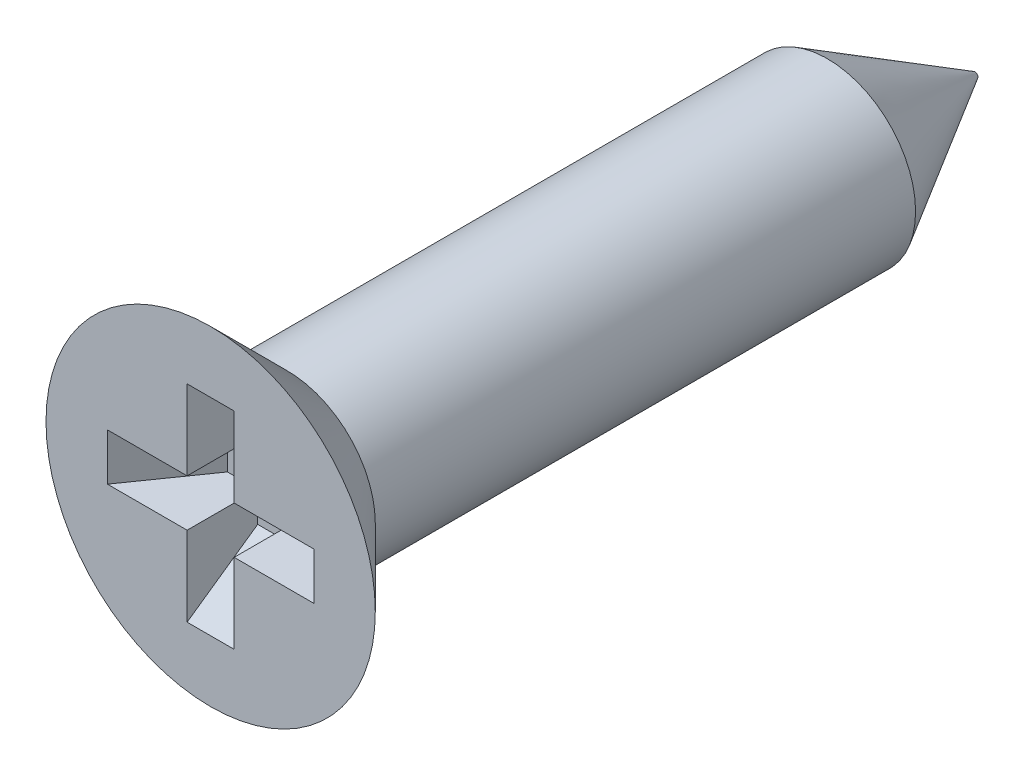
ISO-10303-21;
HEADER;
FILE_DESCRIPTION(('STEP AP214'),'2;1');
FILE_NAME('part.step','',(''),(''),'','','');
FILE_SCHEMA(('AUTOMOTIVE_DESIGN { 1 0 10303 214 1 1 1 1 }'));
ENDSEC;
DATA;
#1=APPLICATION_CONTEXT('core data for automotive mechanical design processes');
#2=APPLICATION_PROTOCOL_DEFINITION('international standard','automotive_design',2000,#1);
#3=PRODUCT_CONTEXT('',#1,'mechanical');
#4=PRODUCT('Part','Part','',(#3));
#5=PRODUCT_RELATED_PRODUCT_CATEGORY('part','',(#4));
#6=PRODUCT_DEFINITION_FORMATION('','',#4);
#7=PRODUCT_DEFINITION_CONTEXT('part definition',#1,'design');
#8=PRODUCT_DEFINITION('design','',#6,#7);
#9=PRODUCT_DEFINITION_SHAPE('','',#8);
#10=(LENGTH_UNIT() NAMED_UNIT(*) SI_UNIT(.MILLI.,.METRE.));
#11=(NAMED_UNIT(*) PLANE_ANGLE_UNIT() SI_UNIT($,.RADIAN.));
#12=(NAMED_UNIT(*) SI_UNIT($,.STERADIAN.) SOLID_ANGLE_UNIT());
#13=UNCERTAINTY_MEASURE_WITH_UNIT(LENGTH_MEASURE(1.E-05),#10,'distance_accuracy_value','');
#14=(GEOMETRIC_REPRESENTATION_CONTEXT(3) GLOBAL_UNCERTAINTY_ASSIGNED_CONTEXT((#13)) GLOBAL_UNIT_ASSIGNED_CONTEXT((#10,
#11,#12)) REPRESENTATION_CONTEXT('',''));
#15=CARTESIAN_POINT('',(0.,0.,0.));
#16=DIRECTION('',(0.,0.,1.));
#17=DIRECTION('',(1.,0.,0.));
#18=AXIS2_PLACEMENT_3D('',#15,#16,#17);
#19=CARTESIAN_POINT('',(-1.75499287747842,1.75499287747842,-1.2));
#20=DIRECTION('',(0.,0.,-1.));
#21=DIRECTION('',(-1.,0.,0.));
#22=AXIS2_PLACEMENT_3D('',#19,#20,#21);
#23=PLANE('',#22);
#24=DIRECTION('',(-1.,0.,0.));
#25=VECTOR('',#24,1.);
#26=CARTESIAN_POINT('',(-1.75499287747842,0.4,-1.2));
#27=LINE('',#26,#25);
#28=CARTESIAN_POINT('',(-0.4,0.4,-1.2));
#29=VERTEX_POINT('',#28);
#30=CARTESIAN_POINT('',(-0.91474383162677,0.4,-1.2));
#31=VERTEX_POINT('',#30);
#32=EDGE_CURVE('E145',#29,#31,#27,.T.);
#33=ORIENTED_EDGE('',*,*,#32,.T.);
#34=DIRECTION('',(0.,1.,0.));
#35=VECTOR('',#34,1.);
#36=CARTESIAN_POINT('',(-0.91474383162677,-0.4,-1.2));
#37=LINE('',#36,#35);
#38=CARTESIAN_POINT('',(-0.91474383162677,-0.4,-1.2));
#39=VERTEX_POINT('',#38);
#40=EDGE_CURVE('E132',#31,#39,#37,.F.);
#41=ORIENTED_EDGE('',*,*,#40,.T.);
#42=DIRECTION('',(1.,0.,0.));
#43=VECTOR('',#42,1.);
#44=CARTESIAN_POINT('',(-1.75499287747842,-0.4,-1.2));
#45=LINE('',#44,#43);
#46=CARTESIAN_POINT('',(-0.4,-0.4,-1.2));
#47=VERTEX_POINT('',#46);
#48=EDGE_CURVE('E128',#39,#47,#45,.T.);
#49=ORIENTED_EDGE('',*,*,#48,.T.);
#50=DIRECTION('',(0.,-1.,0.));
#51=VECTOR('',#50,1.);
#52=CARTESIAN_POINT('',(-0.4,-0.4,-1.2));
#53=LINE('',#52,#51);
#54=CARTESIAN_POINT('',(-0.4,-0.91474383162677,-1.2));
#55=VERTEX_POINT('',#54);
#56=EDGE_CURVE('E119',#47,#55,#53,.T.);
#57=ORIENTED_EDGE('',*,*,#56,.T.);
#58=DIRECTION('',(-1.,0.,0.));
#59=VECTOR('',#58,1.);
#60=CARTESIAN_POINT('',(0.4,-0.91474383162677,-1.2));
#61=LINE('',#60,#59);
#62=CARTESIAN_POINT('',(0.4,-0.91474383162677,-1.2));
#63=VERTEX_POINT('',#62);
#64=EDGE_CURVE('E173',#55,#63,#61,.F.);
#65=ORIENTED_EDGE('',*,*,#64,.T.);
#66=DIRECTION('',(0.,1.,0.));
#67=VECTOR('',#66,1.);
#68=CARTESIAN_POINT('',(0.4,-0.4,-1.2));
#69=LINE('',#68,#67);
#70=CARTESIAN_POINT('',(0.4,-0.4,-1.2));
#71=VERTEX_POINT('',#70);
#72=EDGE_CURVE('E127',#63,#71,#69,.T.);
#73=ORIENTED_EDGE('',*,*,#72,.T.);
#74=DIRECTION('',(1.,0.,0.));
#75=VECTOR('',#74,1.);
#76=CARTESIAN_POINT('',(0.4,-0.4,-1.2));
#77=LINE('',#76,#75);
#78=CARTESIAN_POINT('',(0.91474383162677,-0.4,-1.2));
#79=VERTEX_POINT('',#78);
#80=EDGE_CURVE('E410',#71,#79,#77,.T.);
#81=ORIENTED_EDGE('',*,*,#80,.T.);
#82=DIRECTION('',(0.,-1.,0.));
#83=VECTOR('',#82,1.);
#84=CARTESIAN_POINT('',(0.91474383162677,0.4,-1.2));
#85=LINE('',#84,#83);
#86=CARTESIAN_POINT('',(0.91474383162677,0.4,-1.2));
#87=VERTEX_POINT('',#86);
#88=EDGE_CURVE('E47',#79,#87,#85,.F.);
#89=ORIENTED_EDGE('',*,*,#88,.T.);
#90=DIRECTION('',(-1.,0.,0.));
#91=VECTOR('',#90,1.);
#92=CARTESIAN_POINT('',(0.4,0.4,-1.2));
#93=LINE('',#92,#91);
#94=CARTESIAN_POINT('',(0.4,0.4,-1.2));
#95=VERTEX_POINT('',#94);
#96=EDGE_CURVE('E359',#87,#95,#93,.T.);
#97=ORIENTED_EDGE('',*,*,#96,.T.);
#98=DIRECTION('',(0.,1.,0.));
#99=VECTOR('',#98,1.);
#100=CARTESIAN_POINT('',(0.4,1.75499287747842,-1.2));
#101=LINE('',#100,#99);
#102=CARTESIAN_POINT('',(0.4,0.91474383162677,-1.2));
#103=VERTEX_POINT('',#102);
#104=EDGE_CURVE('E357',#95,#103,#101,.T.);
#105=ORIENTED_EDGE('',*,*,#104,.T.);
#106=DIRECTION('',(1.,0.,0.));
#107=VECTOR('',#106,1.);
#108=CARTESIAN_POINT('',(-0.4,0.91474383162677,-1.2));
#109=LINE('',#108,#107);
#110=CARTESIAN_POINT('',(-0.4,0.91474383162677,-1.2));
#111=VERTEX_POINT('',#110);
#112=EDGE_CURVE('E171',#103,#111,#109,.F.);
#113=ORIENTED_EDGE('',*,*,#112,.T.);
#114=DIRECTION('',(0.,-1.,0.));
#115=VECTOR('',#114,1.);
#116=CARTESIAN_POINT('',(-0.4,1.75499287747842,-1.2));
#117=LINE('',#116,#115);
#118=EDGE_CURVE('E361',#111,#29,#117,.T.);
#119=ORIENTED_EDGE('',*,*,#118,.T.);
#120=EDGE_LOOP('',(#33,#41,#49,#57,#65,#73,#81,#89,#97,#105,#113,#119));
#121=FACE_BOUND('',#120,.T.);
#122=ADVANCED_FACE('F32',(#121),#23,.F.);
#123=CARTESIAN_POINT('',(-1.75499287747842,-0.4,0.));
#124=DIRECTION('',(0.819152044288991,0.,0.573576436351047));
#125=DIRECTION('',(0.573576436351047,0.,-0.819152044288991));
#126=AXIS2_PLACEMENT_3D('',#123,#124,#125);
#127=PLANE('',#126);
#128=ORIENTED_EDGE('',*,*,#40,.F.);
#129=DIRECTION('',(0.573576436351047,0.,-0.819152044288991));
#130=VECTOR('',#129,1.);
#131=CARTESIAN_POINT('',(-1.19117730500688,0.4,-0.8052120859954));
#132=LINE('',#131,#130);
#133=CARTESIAN_POINT('',(-1.75499287747842,0.4,0.));
#134=VERTEX_POINT('',#133);
#135=EDGE_CURVE('E155',#31,#134,#132,.F.);
#136=ORIENTED_EDGE('',*,*,#135,.T.);
#137=DIRECTION('',(0.,-1.,0.));
#138=VECTOR('',#137,1.);
#139=CARTESIAN_POINT('',(-1.75499287747842,-0.4,0.));
#140=LINE('',#139,#138);
#141=CARTESIAN_POINT('',(-1.75499287747842,-0.4,0.));
#142=VERTEX_POINT('',#141);
#143=EDGE_CURVE('E386',#134,#142,#140,.T.);
#144=ORIENTED_EDGE('',*,*,#143,.T.);
#145=DIRECTION('',(0.573576436351047,0.,-0.819152044288991));
#146=VECTOR('',#145,1.);
#147=CARTESIAN_POINT('',(-1.75499287747842,-0.4,0.));
#148=LINE('',#147,#146);
#149=EDGE_CURVE('E141',#39,#142,#148,.F.);
#150=ORIENTED_EDGE('',*,*,#149,.F.);
#151=EDGE_LOOP('',(#128,#136,#144,#150));
#152=FACE_BOUND('',#151,.T.);
#153=ADVANCED_FACE('F189',(#152),#127,.T.);
#154=CARTESIAN_POINT('',(0.4,-1.75499287747842,0.));
#155=DIRECTION('',(0.,0.819152044288991,0.573576436351047));
#156=DIRECTION('',(0.,-0.573576436351047,0.819152044288991));
#157=AXIS2_PLACEMENT_3D('',#154,#155,#156);
#158=PLANE('',#157);
#159=ORIENTED_EDGE('',*,*,#64,.F.);
#160=DIRECTION('',(0.,0.573576436351047,-0.819152044288991));
#161=VECTOR('',#160,1.);
#162=CARTESIAN_POINT('',(-0.4,-0.74539829534788,-1.44185049008737));
#163=LINE('',#162,#161);
#164=CARTESIAN_POINT('',(-0.4,-1.75499287747842,0.));
#165=VERTEX_POINT('',#164);
#166=EDGE_CURVE('E126',#55,#165,#163,.F.);
#167=ORIENTED_EDGE('',*,*,#166,.T.);
#168=DIRECTION('',(1.,0.,0.));
#169=VECTOR('',#168,1.);
#170=CARTESIAN_POINT('',(0.4,-1.75499287747842,0.));
#171=LINE('',#170,#169);
#172=CARTESIAN_POINT('',(0.4,-1.75499287747842,0.));
#173=VERTEX_POINT('',#172);
#174=EDGE_CURVE('E394',#165,#173,#171,.T.);
#175=ORIENTED_EDGE('',*,*,#174,.T.);
#176=DIRECTION('',(0.,0.573576436351047,-0.819152044288991));
#177=VECTOR('',#176,1.);
#178=CARTESIAN_POINT('',(0.4,-1.75499287747842,0.));
#179=LINE('',#178,#177);
#180=EDGE_CURVE('E143',#63,#173,#179,.F.);
#181=ORIENTED_EDGE('',*,*,#180,.F.);
#182=EDGE_LOOP('',(#159,#167,#175,#181));
#183=FACE_BOUND('',#182,.T.);
#184=ADVANCED_FACE('F194',(#183),#158,.T.);
#185=CARTESIAN_POINT('',(-0.4,1.75499287747842,0.));
#186=DIRECTION('',(0.,-0.819152044288991,0.573576436351047));
#187=DIRECTION('',(0.,-0.573576436351047,-0.819152044288991));
#188=AXIS2_PLACEMENT_3D('',#185,#186,#187);
#189=PLANE('',#188);
#190=ORIENTED_EDGE('',*,*,#112,.F.);
#191=DIRECTION('',(0.,-0.573576436351047,-0.819152044288991));
#192=VECTOR('',#191,1.);
#193=CARTESIAN_POINT('',(0.4,1.19117730500688,-0.8052120859954));
#194=LINE('',#193,#192);
#195=CARTESIAN_POINT('',(0.4,1.75499287747842,0.));
#196=VERTEX_POINT('',#195);
#197=EDGE_CURVE('E161',#103,#196,#194,.F.);
#198=ORIENTED_EDGE('',*,*,#197,.T.);
#199=DIRECTION('',(-1.,0.,0.));
#200=VECTOR('',#199,1.);
#201=CARTESIAN_POINT('',(-0.4,1.75499287747842,0.));
#202=LINE('',#201,#200);
#203=CARTESIAN_POINT('',(-0.4,1.75499287747842,0.));
#204=VERTEX_POINT('',#203);
#205=EDGE_CURVE('E368',#196,#204,#202,.T.);
#206=ORIENTED_EDGE('',*,*,#205,.T.);
#207=DIRECTION('',(0.,-0.573576436351047,-0.819152044288991));
#208=VECTOR('',#207,1.);
#209=CARTESIAN_POINT('',(-0.4,1.75499287747842,0.));
#210=LINE('',#209,#208);
#211=EDGE_CURVE('E163',#111,#204,#210,.F.);
#212=ORIENTED_EDGE('',*,*,#211,.F.);
#213=EDGE_LOOP('',(#190,#198,#206,#212));
#214=FACE_BOUND('',#213,.T.);
#215=ADVANCED_FACE('F241',(#214),#189,.T.);
#216=CARTESIAN_POINT('',(1.75499287747842,0.4,0.));
#217=DIRECTION('',(-0.819152044288991,0.,0.573576436351047));
#218=DIRECTION('',(0.573576436351047,0.,0.819152044288991));
#219=AXIS2_PLACEMENT_3D('',#216,#217,#218);
#220=PLANE('',#219);
#221=ORIENTED_EDGE('',*,*,#88,.F.);
#222=DIRECTION('',(-0.573576436351047,0.,-0.819152044288991));
#223=VECTOR('',#222,1.);
#224=CARTESIAN_POINT('',(0.74539829534788,-0.4,-1.44185049008737));
#225=LINE('',#224,#223);
#226=CARTESIAN_POINT('',(1.75499287747842,-0.4,0.));
#227=VERTEX_POINT('',#226);
#228=EDGE_CURVE('E166',#79,#227,#225,.F.);
#229=ORIENTED_EDGE('',*,*,#228,.T.);
#230=DIRECTION('',(0.,1.,0.));
#231=VECTOR('',#230,1.);
#232=CARTESIAN_POINT('',(1.75499287747842,0.4,0.));
#233=LINE('',#232,#231);
#234=CARTESIAN_POINT('',(1.75499287747842,0.4,0.));
#235=VERTEX_POINT('',#234);
#236=EDGE_CURVE('E403',#227,#235,#233,.T.);
#237=ORIENTED_EDGE('',*,*,#236,.T.);
#238=DIRECTION('',(-0.573576436351047,0.,-0.819152044288991));
#239=VECTOR('',#238,1.);
#240=CARTESIAN_POINT('',(1.75499287747842,0.4,0.));
#241=LINE('',#240,#239);
#242=EDGE_CURVE('E168',#87,#235,#241,.F.);
#243=ORIENTED_EDGE('',*,*,#242,.F.);
#244=EDGE_LOOP('',(#221,#229,#237,#243));
#245=FACE_BOUND('',#244,.T.);
#246=ADVANCED_FACE('F236',(#245),#220,.T.);
#247=CARTESIAN_POINT('',(0.,2.8,0.));
#248=DIRECTION('',(0.,0.,-1.));
#249=DIRECTION('',(-1.,0.,0.));
#250=AXIS2_PLACEMENT_3D('',#247,#248,#249);
#251=PLANE('',#250);
#252=DIRECTION('',(1.,0.,0.));
#253=VECTOR('',#252,1.);
#254=CARTESIAN_POINT('',(-1.75499287747842,-0.4,0.));
#255=LINE('',#254,#253);
#256=CARTESIAN_POINT('',(-0.4,-0.4,0.));
#257=VERTEX_POINT('',#256);
#258=EDGE_CURVE('E139',#142,#257,#255,.T.);
#259=ORIENTED_EDGE('',*,*,#258,.F.);
#260=ORIENTED_EDGE('',*,*,#143,.F.);
#261=DIRECTION('',(-1.,0.,0.));
#262=VECTOR('',#261,1.);
#263=CARTESIAN_POINT('',(-1.75499287747842,0.4,0.));
#264=LINE('',#263,#262);
#265=CARTESIAN_POINT('',(-0.4,0.4,0.));
#266=VERTEX_POINT('',#265);
#267=EDGE_CURVE('E135',#266,#134,#264,.T.);
#268=ORIENTED_EDGE('',*,*,#267,.F.);
#269=DIRECTION('',(0.,-1.,0.));
#270=VECTOR('',#269,1.);
#271=CARTESIAN_POINT('',(-0.4,1.75499287747842,0.));
#272=LINE('',#271,#270);
#273=EDGE_CURVE('E375',#204,#266,#272,.T.);
#274=ORIENTED_EDGE('',*,*,#273,.F.);
#275=ORIENTED_EDGE('',*,*,#205,.F.);
#276=DIRECTION('',(0.,1.,0.));
#277=VECTOR('',#276,1.);
#278=CARTESIAN_POINT('',(0.4,1.75499287747842,0.));
#279=LINE('',#278,#277);
#280=CARTESIAN_POINT('',(0.4,0.4,0.));
#281=VERTEX_POINT('',#280);
#282=EDGE_CURVE('E364',#281,#196,#279,.T.);
#283=ORIENTED_EDGE('',*,*,#282,.F.);
#284=DIRECTION('',(-1.,0.,0.));
#285=VECTOR('',#284,1.);
#286=CARTESIAN_POINT('',(0.4,0.4,0.));
#287=LINE('',#286,#285);
#288=EDGE_CURVE('E369',#235,#281,#287,.T.);
#289=ORIENTED_EDGE('',*,*,#288,.F.);
#290=ORIENTED_EDGE('',*,*,#236,.F.);
#291=DIRECTION('',(1.,0.,0.));
#292=VECTOR('',#291,1.);
#293=CARTESIAN_POINT('',(0.4,-0.4,0.));
#294=LINE('',#293,#292);
#295=CARTESIAN_POINT('',(0.4,-0.4,0.));
#296=VERTEX_POINT('',#295);
#297=EDGE_CURVE('E400',#296,#227,#294,.T.);
#298=ORIENTED_EDGE('',*,*,#297,.F.);
#299=DIRECTION('',(0.,1.,0.));
#300=VECTOR('',#299,1.);
#301=CARTESIAN_POINT('',(0.4,-0.4,0.));
#302=LINE('',#301,#300);
#303=EDGE_CURVE('E397',#173,#296,#302,.T.);
#304=ORIENTED_EDGE('',*,*,#303,.F.);
#305=ORIENTED_EDGE('',*,*,#174,.F.);
#306=DIRECTION('',(0.,-1.,0.));
#307=VECTOR('',#306,1.);
#308=CARTESIAN_POINT('',(-0.4,-0.4,0.));
#309=LINE('',#308,#307);
#310=EDGE_CURVE('E388',#257,#165,#309,.T.);
#311=ORIENTED_EDGE('',*,*,#310,.F.);
#312=EDGE_LOOP('',(#259,#260,#268,#274,#275,#283,#289,#290,#298,#304,#305,#311));
#313=FACE_BOUND('',#312,.T.);
#314=CARTESIAN_POINT('',(0.,0.,0.));
#315=DIRECTION('',(0.,0.,1.));
#316=DIRECTION('',(1.,0.,0.));
#317=AXIS2_PLACEMENT_3D('',#314,#315,#316);
#318=CIRCLE('',#317,2.8);
#319=CARTESIAN_POINT('',(2.8,0.,0.));
#320=VERTEX_POINT('',#319);
#321=EDGE_CURVE('E154',#320,#320,#318,.T.);
#322=ORIENTED_EDGE('',*,*,#321,.T.);
#323=EDGE_LOOP('',(#322));
#324=FACE_BOUND('',#323,.T.);
#325=ADVANCED_FACE('F233',(#313,#324),#251,.F.);
#326=CARTESIAN_POINT('',(0.,0.,-1.3));
#327=DIRECTION('',(0.,0.,1.));
#328=DIRECTION('',(1.,0.,0.));
#329=AXIS2_PLACEMENT_3D('',#326,#327,#328);
#330=CONICAL_SURFACE('',#329,1.5,0.78539816339745);
#331=ORIENTED_EDGE('',*,*,#321,.F.);
#332=EDGE_LOOP('',(#331));
#333=FACE_BOUND('',#332,.T.);
#334=CARTESIAN_POINT('',(0.,0.,-1.3));
#335=DIRECTION('',(0.,0.,1.));
#336=DIRECTION('',(1.,0.,0.));
#337=AXIS2_PLACEMENT_3D('',#334,#335,#336);
#338=CIRCLE('',#337,1.5);
#339=CARTESIAN_POINT('',(1.5,0.,-1.3));
#340=VERTEX_POINT('',#339);
#341=EDGE_CURVE('E151',#340,#340,#338,.T.);
#342=ORIENTED_EDGE('',*,*,#341,.T.);
#343=EDGE_LOOP('',(#342));
#344=FACE_BOUND('',#343,.T.);
#345=ADVANCED_FACE('F230',(#333,#344),#330,.T.);
#346=CARTESIAN_POINT('',(0.,0.,-13.));
#347=DIRECTION('',(0.,0.,1.));
#348=DIRECTION('',(1.,0.,0.));
#349=AXIS2_PLACEMENT_3D('',#346,#347,#348);
#350=CYLINDRICAL_SURFACE('',#349,1.5);
#351=CARTESIAN_POINT('',(0.,0.,-10.4885263290251));
#352=DIRECTION('',(0.,0.,1.));
#353=DIRECTION('',(1.,0.,0.));
#354=AXIS2_PLACEMENT_3D('',#351,#352,#353);
#355=CIRCLE('',#354,1.5);
#356=CARTESIAN_POINT('',(1.5,0.,-10.4885263290251));
#357=VERTEX_POINT('',#356);
#358=EDGE_CURVE('E40',#357,#357,#355,.T.);
#359=CARTESIAN_POINT('',(1.5,0.,-10.4885263290251));
#360=CARTESIAN_POINT('',(1.5,0.,-10.3928125130978));
#361=CARTESIAN_POINT('',(1.5,0.,-10.2970986971704));
#362=CARTESIAN_POINT('',(1.5,0.,-10.1056710653157));
#363=CARTESIAN_POINT('',(1.5,0.,-10.0099572493884));
#364=CARTESIAN_POINT('',(1.5,0.,-9.81852961753368));
#365=CARTESIAN_POINT('',(1.5,0.,-9.72281580160634));
#366=CARTESIAN_POINT('',(1.5,0.,-9.53138816975165));
#367=CARTESIAN_POINT('',(1.5,0.,-9.4356743538243));
#368=CARTESIAN_POINT('',(1.5,0.,-9.24424672196961));
#369=CARTESIAN_POINT('',(1.5,0.,-9.14853290604227));
#370=CARTESIAN_POINT('',(1.5,0.,-8.95710527418758));
#371=CARTESIAN_POINT('',(1.5,0.,-8.86139145826023));
#372=CARTESIAN_POINT('',(1.5,0.,-8.66996382640555));
#373=CARTESIAN_POINT('',(1.5,0.,-8.5742500104782));
#374=CARTESIAN_POINT('',(1.5,0.,-8.38282237862351));
#375=CARTESIAN_POINT('',(1.5,0.,-8.28710856269617));
#376=CARTESIAN_POINT('',(1.5,0.,-8.09568093084148));
#377=CARTESIAN_POINT('',(1.5,0.,-7.99996711491413));
#378=CARTESIAN_POINT('',(1.5,0.,-7.80853948305944));
#379=CARTESIAN_POINT('',(1.5,0.,-7.7128256671321));
#380=CARTESIAN_POINT('',(1.5,0.,-7.52139803527741));
#381=CARTESIAN_POINT('',(1.5,0.,-7.42568421935006));
#382=CARTESIAN_POINT('',(1.5,0.,-7.23425658749537));
#383=CARTESIAN_POINT('',(1.5,0.,-7.13854277156803));
#384=CARTESIAN_POINT('',(1.5,0.,-6.94711513971334));
#385=CARTESIAN_POINT('',(1.5,0.,-6.85140132378599));
#386=CARTESIAN_POINT('',(1.5,0.,-6.6599736919313));
#387=CARTESIAN_POINT('',(1.5,0.,-6.56425987600396));
#388=CARTESIAN_POINT('',(1.5,0.,-6.37283224414927));
#389=CARTESIAN_POINT('',(1.5,0.,-6.27711842822193));
#390=CARTESIAN_POINT('',(1.5,0.,-6.08569079636724));
#391=CARTESIAN_POINT('',(1.5,0.,-5.98997698043989));
#392=CARTESIAN_POINT('',(1.5,0.,-5.7985493485852));
#393=CARTESIAN_POINT('',(1.5,0.,-5.70283553265786));
#394=CARTESIAN_POINT('',(1.5,0.,-5.51140790080317));
#395=CARTESIAN_POINT('',(1.5,0.,-5.41569408487582));
#396=CARTESIAN_POINT('',(1.5,0.,-5.22426645302113));
#397=CARTESIAN_POINT('',(1.5,0.,-5.12855263709379));
#398=CARTESIAN_POINT('',(1.5,0.,-4.9371250052391));
#399=CARTESIAN_POINT('',(1.5,0.,-4.84141118931175));
#400=CARTESIAN_POINT('',(1.5,0.,-4.64998355745706));
#401=CARTESIAN_POINT('',(1.5,0.,-4.55426974152972));
#402=CARTESIAN_POINT('',(1.5,0.,-4.36284210967503));
#403=CARTESIAN_POINT('',(1.5,0.,-4.26712829374769));
#404=CARTESIAN_POINT('',(1.5,0.,-4.075700661893));
#405=CARTESIAN_POINT('',(1.5,0.,-3.97998684596565));
#406=CARTESIAN_POINT('',(1.5,0.,-3.78855921411096));
#407=CARTESIAN_POINT('',(1.5,0.,-3.69284539818362));
#408=CARTESIAN_POINT('',(1.5,0.,-3.50141776632893));
#409=CARTESIAN_POINT('',(1.5,0.,-3.40570395040158));
#410=CARTESIAN_POINT('',(1.5,0.,-3.21427631854689));
#411=CARTESIAN_POINT('',(1.5,0.,-3.11856250261955));
#412=CARTESIAN_POINT('',(1.5,0.,-2.92713487076486));
#413=CARTESIAN_POINT('',(1.5,0.,-2.83142105483751));
#414=CARTESIAN_POINT('',(1.5,0.,-2.63999342298282));
#415=CARTESIAN_POINT('',(1.5,0.,-2.54427960705548));
#416=CARTESIAN_POINT('',(1.5,0.,-2.35285197520079));
#417=CARTESIAN_POINT('',(1.5,0.,-2.25713815927344));
#418=CARTESIAN_POINT('',(1.5,0.,-2.06571052741875));
#419=CARTESIAN_POINT('',(1.5,0.,-1.96999671149141));
#420=CARTESIAN_POINT('',(1.5,0.,-1.77856907963672));
#421=CARTESIAN_POINT('',(1.5,0.,-1.68285526370938));
#422=CARTESIAN_POINT('',(1.5,0.,-1.49142763185469));
#423=CARTESIAN_POINT('',(1.5,0.,-1.39571381592734));
#424=CARTESIAN_POINT('',(1.5,0.,-1.3));
#425=B_SPLINE_CURVE_WITH_KNOTS('',3,(#359,#360,#361,#362,#363,#364,#365,#366,#367,#368,#369,
#370,#371,#372,#373,#374,#375,#376,#377,#378,#379,#380,#381,#382,#383,#384,#385,#386,#387,#388,
#389,#390,#391,#392,#393,#394,#395,#396,#397,#398,#399,#400,#401,#402,#403,#404,#405,#406,#407,
#408,#409,#410,#411,#412,#413,#414,#415,#416,#417,#418,#419,#420,#421,#422,#423,#424),
.UNSPECIFIED.,.F.,.F.,(4,2,2,2,2,2,2,2,2,2,2,2,2,2,2,2,2,2,2,2,2,2,2,2,2,2,2,2,2,2,2,2,4),(0.,
0.287141447782033,0.574282895564068,0.861424343346103,1.14856579112814,1.43570723891017,
1.72284868669221,2.00999013447424,2.29713158225627,2.58427303003831,2.87141447782034,
3.15855592560238,3.44569737338441,3.73283882116645,4.01998026894848,4.30712171673051,
4.59426316451255,4.88140461229458,5.16854606007662,5.45568750785865,5.74282895564069,
6.02997040342272,6.31711185120475,6.60425329898679,6.89139474676882,7.17853619455086,
7.46567764233289,7.75281909011493,8.03996053789696,8.327101985679,8.61424343346103,
8.90138488124306,9.1885263290251),.UNSPECIFIED.);
#426=EDGE_CURVE('BSEAM178',#357,#340,#425,.T.);
#427=ORIENTED_EDGE('',*,*,#358,.T.);
#428=ORIENTED_EDGE('',*,*,#341,.F.);
#429=ORIENTED_EDGE('',*,*,#426,.T.);
#430=ORIENTED_EDGE('',*,*,#426,.F.);
#431=EDGE_LOOP('',(#427,#429,#428,#430));
#432=FACE_BOUND('',#431,.T.);
#433=ADVANCED_FACE('F178',(#432),#350,.T.);
#434=CARTESIAN_POINT('',(0.,0.,-13.));
#435=DIRECTION('',(0.,0.,1.));
#436=DIRECTION('',(1.,0.,0.));
#437=AXIS2_PLACEMENT_3D('',#434,#435,#436);
#438=PLANE('',#437);
#439=CARTESIAN_POINT('',(0.,0.,-13.));
#440=DIRECTION('',(0.,0.,1.));
#441=DIRECTION('',(1.,0.,0.));
#442=AXIS2_PLACEMENT_3D('',#439,#440,#441);
#443=CIRCLE('',#442,0.0499999999999914);
#444=CARTESIAN_POINT('',(0.049999999999991,0.,-13.));
#445=VERTEX_POINT('',#444);
#446=EDGE_CURVE('E11',#445,#445,#443,.F.);
#447=ORIENTED_EDGE('',*,*,#446,.T.);
#448=EDGE_LOOP('',(#447));
#449=FACE_BOUND('',#448,.T.);
#450=ADVANCED_FACE('F202',(#449),#438,.F.);
#451=CARTESIAN_POINT('',(-1.75499287747842,0.4,-1.2));
#452=DIRECTION('',(0.,1.,0.));
#453=DIRECTION('',(-1.,0.,0.));
#454=AXIS2_PLACEMENT_3D('',#451,#452,#453);
#455=PLANE('',#454);
#456=ORIENTED_EDGE('',*,*,#135,.F.);
#457=ORIENTED_EDGE('',*,*,#32,.F.);
#458=DIRECTION('',(0.,0.,1.));
#459=VECTOR('',#458,1.);
#460=CARTESIAN_POINT('',(-0.4,0.4,-1.2));
#461=LINE('',#460,#459);
#462=EDGE_CURVE('E158',#29,#266,#461,.T.);
#463=ORIENTED_EDGE('',*,*,#462,.T.);
#464=ORIENTED_EDGE('',*,*,#267,.T.);
#465=EDGE_LOOP('',(#456,#457,#463,#464));
#466=FACE_BOUND('',#465,.T.);
#467=ADVANCED_FACE('F198',(#466),#455,.F.);
#468=CARTESIAN_POINT('',(-0.4,1.75499287747842,-1.2));
#469=DIRECTION('',(-1.,0.,0.));
#470=DIRECTION('',(0.,-1.,0.));
#471=AXIS2_PLACEMENT_3D('',#468,#469,#470);
#472=PLANE('',#471);
#473=ORIENTED_EDGE('',*,*,#118,.F.);
#474=ORIENTED_EDGE('',*,*,#211,.T.);
#475=ORIENTED_EDGE('',*,*,#273,.T.);
#476=ORIENTED_EDGE('',*,*,#462,.F.);
#477=EDGE_LOOP('',(#473,#474,#475,#476));
#478=FACE_BOUND('',#477,.T.);
#479=ADVANCED_FACE('F201',(#478),#472,.F.);
#480=CARTESIAN_POINT('',(0.4,1.75499287747842,-1.2));
#481=DIRECTION('',(1.,0.,0.));
#482=DIRECTION('',(0.,0.,-1.));
#483=AXIS2_PLACEMENT_3D('',#480,#481,#482);
#484=PLANE('',#483);
#485=ORIENTED_EDGE('',*,*,#197,.F.);
#486=ORIENTED_EDGE('',*,*,#104,.F.);
#487=DIRECTION('',(0.,0.,1.));
#488=VECTOR('',#487,1.);
#489=CARTESIAN_POINT('',(0.4,0.4,-1.2));
#490=LINE('',#489,#488);
#491=EDGE_CURVE('E164',#95,#281,#490,.T.);
#492=ORIENTED_EDGE('',*,*,#491,.T.);
#493=ORIENTED_EDGE('',*,*,#282,.T.);
#494=EDGE_LOOP('',(#485,#486,#492,#493));
#495=FACE_BOUND('',#494,.T.);
#496=ADVANCED_FACE('F206',(#495),#484,.F.);
#497=CARTESIAN_POINT('',(0.4,0.4,-1.2));
#498=DIRECTION('',(0.,1.,0.));
#499=DIRECTION('',(-1.,0.,0.));
#500=AXIS2_PLACEMENT_3D('',#497,#498,#499);
#501=PLANE('',#500);
#502=ORIENTED_EDGE('',*,*,#96,.F.);
#503=ORIENTED_EDGE('',*,*,#242,.T.);
#504=ORIENTED_EDGE('',*,*,#288,.T.);
#505=ORIENTED_EDGE('',*,*,#491,.F.);
#506=EDGE_LOOP('',(#502,#503,#504,#505));
#507=FACE_BOUND('',#506,.T.);
#508=ADVANCED_FACE('F210',(#507),#501,.F.);
#509=CARTESIAN_POINT('',(0.4,-0.4,-1.2));
#510=DIRECTION('',(0.,-1.,0.));
#511=DIRECTION('',(1.,0.,0.));
#512=AXIS2_PLACEMENT_3D('',#509,#510,#511);
#513=PLANE('',#512);
#514=ORIENTED_EDGE('',*,*,#228,.F.);
#515=ORIENTED_EDGE('',*,*,#80,.F.);
#516=DIRECTION('',(0.,0.,1.));
#517=VECTOR('',#516,1.);
#518=CARTESIAN_POINT('',(0.4,-0.4,-1.2));
#519=LINE('',#518,#517);
#520=EDGE_CURVE('E149',#71,#296,#519,.T.);
#521=ORIENTED_EDGE('',*,*,#520,.T.);
#522=ORIENTED_EDGE('',*,*,#297,.T.);
#523=EDGE_LOOP('',(#514,#515,#521,#522));
#524=FACE_BOUND('',#523,.T.);
#525=ADVANCED_FACE('F214',(#524),#513,.F.);
#526=CARTESIAN_POINT('',(0.4,-0.4,-1.2));
#527=DIRECTION('',(1.,0.,0.));
#528=DIRECTION('',(0.,1.,0.));
#529=AXIS2_PLACEMENT_3D('',#526,#527,#528);
#530=PLANE('',#529);
#531=ORIENTED_EDGE('',*,*,#72,.F.);
#532=ORIENTED_EDGE('',*,*,#180,.T.);
#533=ORIENTED_EDGE('',*,*,#303,.T.);
#534=ORIENTED_EDGE('',*,*,#520,.F.);
#535=EDGE_LOOP('',(#531,#532,#533,#534));
#536=FACE_BOUND('',#535,.T.);
#537=ADVANCED_FACE('F218',(#536),#530,.F.);
#538=CARTESIAN_POINT('',(-0.4,-0.4,-1.2));
#539=DIRECTION('',(-1.,0.,0.));
#540=DIRECTION('',(0.,-1.,0.));
#541=AXIS2_PLACEMENT_3D('',#538,#539,#540);
#542=PLANE('',#541);
#543=ORIENTED_EDGE('',*,*,#166,.F.);
#544=ORIENTED_EDGE('',*,*,#56,.F.);
#545=DIRECTION('',(0.,0.,1.));
#546=VECTOR('',#545,1.);
#547=CARTESIAN_POINT('',(-0.4,-0.4,-1.2));
#548=LINE('',#547,#546);
#549=EDGE_CURVE('E124',#47,#257,#548,.T.);
#550=ORIENTED_EDGE('',*,*,#549,.T.);
#551=ORIENTED_EDGE('',*,*,#310,.T.);
#552=EDGE_LOOP('',(#543,#544,#550,#551));
#553=FACE_BOUND('',#552,.T.);
#554=ADVANCED_FACE('F121',(#553),#542,.F.);
#555=CARTESIAN_POINT('',(-1.75499287747842,-0.4,-1.2));
#556=DIRECTION('',(0.,-1.,0.));
#557=DIRECTION('',(1.,0.,0.));
#558=AXIS2_PLACEMENT_3D('',#555,#556,#557);
#559=PLANE('',#558);
#560=ORIENTED_EDGE('',*,*,#48,.F.);
#561=ORIENTED_EDGE('',*,*,#149,.T.);
#562=ORIENTED_EDGE('',*,*,#258,.T.);
#563=ORIENTED_EDGE('',*,*,#549,.F.);
#564=EDGE_LOOP('',(#560,#561,#562,#563));
#565=FACE_BOUND('',#564,.T.);
#566=ADVANCED_FACE('F137',(#565),#559,.F.);
#567=CARTESIAN_POINT('',(0.,0.,-10.4885263290251));
#568=DIRECTION('',(0.,0.,1.));
#569=DIRECTION('',(1.,0.,0.));
#570=AXIS2_PLACEMENT_3D('',#567,#568,#569);
#571=CONICAL_SURFACE('',#570,1.5,0.523598775598296);
#572=CARTESIAN_POINT('',(0.049999999999991,0.,-13.));
#573=CARTESIAN_POINT('',(0.065104166666658,0.,-12.9738388159273));
#574=CARTESIAN_POINT('',(0.0802083333333246,0.,-12.9476776318547));
#575=CARTESIAN_POINT('',(0.110416666666658,0.,-12.8953552637094));
#576=CARTESIAN_POINT('',(0.125520833333325,0.,-12.8691940796367));
#577=CARTESIAN_POINT('',(0.155729166666658,0.,-12.8168717114914));
#578=CARTESIAN_POINT('',(0.170833333333325,0.,-12.7907105274188));
#579=CARTESIAN_POINT('',(0.201041666666659,0.,-12.7383881592734));
#580=CARTESIAN_POINT('',(0.216145833333325,0.,-12.7122269752008));
#581=CARTESIAN_POINT('',(0.246354166666659,0.,-12.6599046070555));
#582=CARTESIAN_POINT('',(0.261458333333326,0.,-12.6337434229828));
#583=CARTESIAN_POINT('',(0.291666666666659,0.,-12.5814210548375));
#584=CARTESIAN_POINT('',(0.306770833333326,0.,-12.5552598707649));
#585=CARTESIAN_POINT('',(0.336979166666659,0.,-12.5029375026196));
#586=CARTESIAN_POINT('',(0.352083333333326,0.,-12.4767763185469));
#587=CARTESIAN_POINT('',(0.38229166666666,0.,-12.4244539504016));
#588=CARTESIAN_POINT('',(0.397395833333326,0.,-12.3982927663289));
#589=CARTESIAN_POINT('',(0.42760416666666,0.,-12.3459703981836));
#590=CARTESIAN_POINT('',(0.442708333333327,0.,-12.319809214111));
#591=CARTESIAN_POINT('',(0.47291666666666,0.,-12.2674868459657));
#592=CARTESIAN_POINT('',(0.488020833333327,0.,-12.241325661893));
#593=CARTESIAN_POINT('',(0.518229166666661,0.,-12.1890032937477));
#594=CARTESIAN_POINT('',(0.533333333333327,0.,-12.162842109675));
#595=CARTESIAN_POINT('',(0.563541666666661,0.,-12.1105197415297));
#596=CARTESIAN_POINT('',(0.578645833333328,0.,-12.0843585574571));
#597=CARTESIAN_POINT('',(0.608854166666661,0.,-12.0320361893118));
#598=CARTESIAN_POINT('',(0.623958333333328,0.,-12.0058750052391));
#599=CARTESIAN_POINT('',(0.654166666666661,0.,-11.9535526370938));
#600=CARTESIAN_POINT('',(0.669270833333328,0.,-11.9273914530211));
#601=CARTESIAN_POINT('',(0.699479166666662,0.,-11.8750690848758));
#602=CARTESIAN_POINT('',(0.714583333333328,0.,-11.8489079008032));
#603=CARTESIAN_POINT('',(0.744791666666662,0.,-11.7965855326579));
#604=CARTESIAN_POINT('',(0.759895833333328,0.,-11.7704243485852));
#605=CARTESIAN_POINT('',(0.790104166666662,0.,-11.7181019804399));
#606=CARTESIAN_POINT('',(0.805208333333329,0.,-11.6919407963672));
#607=CARTESIAN_POINT('',(0.835416666666662,0.,-11.6396184282219));
#608=CARTESIAN_POINT('',(0.850520833333329,0.,-11.6134572441493));
#609=CARTESIAN_POINT('',(0.880729166666663,0.,-11.561134876004));
#610=CARTESIAN_POINT('',(0.89583333333333,0.,-11.5349736919313));
#611=CARTESIAN_POINT('',(0.926041666666663,0.,-11.482651323786));
#612=CARTESIAN_POINT('',(0.94114583333333,0.,-11.4564901397133));
#613=CARTESIAN_POINT('',(0.971354166666663,0.,-11.404167771568));
#614=CARTESIAN_POINT('',(0.98645833333333,0.,-11.3780065874954));
#615=CARTESIAN_POINT('',(1.01666666666666,0.,-11.3256842193501));
#616=CARTESIAN_POINT('',(1.03177083333333,0.,-11.2995230352774));
#617=CARTESIAN_POINT('',(1.06197916666666,0.,-11.2472006671321));
#618=CARTESIAN_POINT('',(1.07708333333333,0.,-11.2210394830594));
#619=CARTESIAN_POINT('',(1.10729166666666,0.,-11.1687171149141));
#620=CARTESIAN_POINT('',(1.12239583333333,0.,-11.1425559308415));
#621=CARTESIAN_POINT('',(1.15260416666666,0.,-11.0902335626962));
#622=CARTESIAN_POINT('',(1.16770833333333,0.,-11.0640723786235));
#623=CARTESIAN_POINT('',(1.19791666666666,0.,-11.0117500104782));
#624=CARTESIAN_POINT('',(1.21302083333333,0.,-10.9855888264055));
#625=CARTESIAN_POINT('',(1.24322916666666,0.,-10.9332664582602));
#626=CARTESIAN_POINT('',(1.25833333333333,0.,-10.9071052741876));
#627=CARTESIAN_POINT('',(1.28854166666667,0.,-10.8547829060423));
#628=CARTESIAN_POINT('',(1.30364583333333,0.,-10.8286217219696));
#629=CARTESIAN_POINT('',(1.33385416666667,0.,-10.7762993538243));
#630=CARTESIAN_POINT('',(1.34895833333333,0.,-10.7501381697516));
#631=CARTESIAN_POINT('',(1.37916666666667,0.,-10.6978158016063));
#632=CARTESIAN_POINT('',(1.39427083333333,0.,-10.6716546175337));
#633=CARTESIAN_POINT('',(1.42447916666667,0.,-10.6193322493884));
#634=CARTESIAN_POINT('',(1.43958333333333,0.,-10.5931710653157));
#635=CARTESIAN_POINT('',(1.46979166666667,0.,-10.5408486971704));
#636=CARTESIAN_POINT('',(1.48489583333333,0.,-10.5146875130978));
#637=CARTESIAN_POINT('',(1.5,0.,-10.4885263290251));
#638=B_SPLINE_CURVE_WITH_KNOTS('',3,(#572,#573,#574,#575,#576,#577,#578,#579,#580,#581,#582,
#583,#584,#585,#586,#587,#588,#589,#590,#591,#592,#593,#594,#595,#596,#597,#598,#599,#600,#601,
#602,#603,#604,#605,#606,#607,#608,#609,#610,#611,#612,#613,#614,#615,#616,#617,#618,#619,#620,
#621,#622,#623,#624,#625,#626,#627,#628,#629,#630,#631,#632,#633,#634,#635,#636,#637),
.UNSPECIFIED.,.F.,.F.,(4,2,2,2,2,2,2,2,2,2,2,2,2,2,2,2,2,2,2,2,2,2,2,2,2,2,2,2,2,2,2,2,4),(0.,
0.0906250000000016,0.181250000000003,0.271875000000004,0.362500000000005,0.453125000000005,
0.543750000000007,0.634375000000009,0.725000000000009,0.815625000000009,0.906250000000011,
0.996875000000012,1.08750000000001,1.17812500000001,1.26875000000001,1.35937500000002,
1.45000000000002,1.54062500000002,1.63125000000002,1.72187500000002,1.81250000000002,
1.90312500000002,1.99375000000002,2.08437500000002,2.17500000000003,2.26562500000003,
2.35625000000003,2.44687500000003,2.53750000000003,2.62812500000003,2.71875000000003,
2.80937500000003,2.90000000000003),.UNSPECIFIED.);
#639=EDGE_CURVE('BSEAM34',#445,#357,#638,.T.);
#640=ORIENTED_EDGE('',*,*,#446,.F.);
#641=ORIENTED_EDGE('',*,*,#358,.F.);
#642=ORIENTED_EDGE('',*,*,#639,.T.);
#643=ORIENTED_EDGE('',*,*,#639,.F.);
#644=EDGE_LOOP('',(#640,#642,#641,#643));
#645=FACE_BOUND('',#644,.T.);
#646=ADVANCED_FACE('F34',(#645),#571,.T.);
#647=CLOSED_SHELL('',(#122,#153,#184,#215,#246,#325,#345,#433,#450,#467,#479,#496,#508,#525,
#537,#554,#566,#646));
#648=MANIFOLD_SOLID_BREP('B2',#647);
#649=ADVANCED_BREP_SHAPE_REPRESENTATION('',(#18,#648),#14);
#650=SHAPE_DEFINITION_REPRESENTATION(#9,#649);
ENDSEC;
END-ISO-10303-21;
